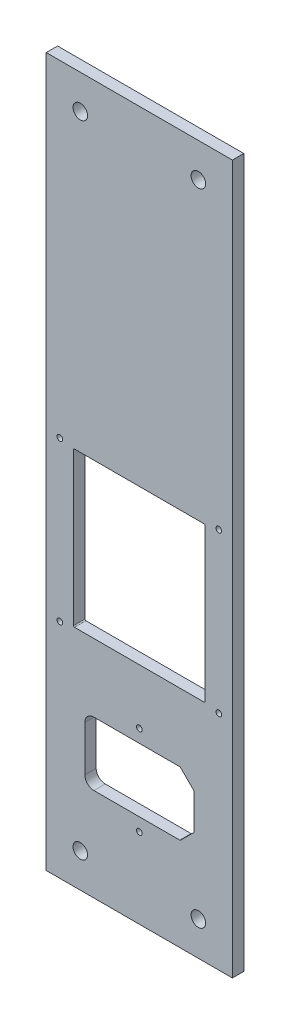
ISO-10303-21;
HEADER;
FILE_DESCRIPTION(('STEP AP214'),'2;1');
FILE_NAME('part.step','',(''),(''),'','','');
FILE_SCHEMA(('AUTOMOTIVE_DESIGN { 1 0 10303 214 1 1 1 1 }'));
ENDSEC;
DATA;
#1=APPLICATION_CONTEXT('core data for automotive mechanical design processes');
#2=APPLICATION_PROTOCOL_DEFINITION('international standard','automotive_design',2000,#1);
#3=PRODUCT_CONTEXT('',#1,'mechanical');
#4=PRODUCT('Part','Part','',(#3));
#5=PRODUCT_RELATED_PRODUCT_CATEGORY('part','',(#4));
#6=PRODUCT_DEFINITION_FORMATION('','',#4);
#7=PRODUCT_DEFINITION_CONTEXT('part definition',#1,'design');
#8=PRODUCT_DEFINITION('design','',#6,#7);
#9=PRODUCT_DEFINITION_SHAPE('','',#8);
#10=(LENGTH_UNIT() NAMED_UNIT(*) SI_UNIT(.MILLI.,.METRE.));
#11=(NAMED_UNIT(*) PLANE_ANGLE_UNIT() SI_UNIT($,.RADIAN.));
#12=(NAMED_UNIT(*) SI_UNIT($,.STERADIAN.) SOLID_ANGLE_UNIT());
#13=UNCERTAINTY_MEASURE_WITH_UNIT(LENGTH_MEASURE(1.E-05),#10,'distance_accuracy_value','');
#14=(GEOMETRIC_REPRESENTATION_CONTEXT(3) GLOBAL_UNCERTAINTY_ASSIGNED_CONTEXT((#13)) GLOBAL_UNIT_ASSIGNED_CONTEXT((#10,
#11,#12)) REPRESENTATION_CONTEXT('',''));
#15=CARTESIAN_POINT('',(0.,0.,0.));
#16=DIRECTION('',(0.,0.,1.));
#17=DIRECTION('',(1.,0.,0.));
#18=AXIS2_PLACEMENT_3D('',#15,#16,#17);
#19=CARTESIAN_POINT('',(41.,-156.,5.));
#20=DIRECTION('',(-1.,0.,0.));
#21=DIRECTION('',(0.,0.,1.));
#22=AXIS2_PLACEMENT_3D('',#19,#20,#21);
#23=PLANE('',#22);
#24=DIRECTION('',(0.,1.,0.));
#25=VECTOR('',#24,1.);
#26=CARTESIAN_POINT('',(41.,-156.,0.));
#27=LINE('',#26,#25);
#28=CARTESIAN_POINT('',(41.,-156.,0.));
#29=VERTEX_POINT('',#28);
#30=CARTESIAN_POINT('',(41.,156.,0.));
#31=VERTEX_POINT('',#30);
#32=EDGE_CURVE('E220',#29,#31,#27,.T.);
#33=ORIENTED_EDGE('',*,*,#32,.T.);
#34=DIRECTION('',(0.,0.,-1.));
#35=VECTOR('',#34,1.);
#36=CARTESIAN_POINT('',(41.,156.,5.));
#37=LINE('',#36,#35);
#38=CARTESIAN_POINT('',(41.,156.,5.));
#39=VERTEX_POINT('',#38);
#40=EDGE_CURVE('E201',#39,#31,#37,.T.);
#41=ORIENTED_EDGE('',*,*,#40,.F.);
#42=DIRECTION('',(0.,1.,0.));
#43=VECTOR('',#42,1.);
#44=CARTESIAN_POINT('',(41.,-156.,5.));
#45=LINE('',#44,#43);
#46=CARTESIAN_POINT('',(41.,-156.,5.));
#47=VERTEX_POINT('',#46);
#48=EDGE_CURVE('E208',#47,#39,#45,.T.);
#49=ORIENTED_EDGE('',*,*,#48,.F.);
#50=DIRECTION('',(0.,0.,-1.));
#51=VECTOR('',#50,1.);
#52=CARTESIAN_POINT('',(41.,-156.,5.));
#53=LINE('',#52,#51);
#54=EDGE_CURVE('E397',#47,#29,#53,.T.);
#55=ORIENTED_EDGE('',*,*,#54,.T.);
#56=EDGE_LOOP('',(#33,#41,#49,#55));
#57=FACE_BOUND('',#56,.T.);
#58=ADVANCED_FACE('F36',(#57),#23,.F.);
#59=CARTESIAN_POINT('',(-41.,156.,5.));
#60=DIRECTION('',(0.,-1.,0.));
#61=DIRECTION('',(0.,0.,-1.));
#62=AXIS2_PLACEMENT_3D('',#59,#60,#61);
#63=PLANE('',#62);
#64=DIRECTION('',(-1.,0.,0.));
#65=VECTOR('',#64,1.);
#66=CARTESIAN_POINT('',(-41.,156.,0.));
#67=LINE('',#66,#65);
#68=CARTESIAN_POINT('',(-41.,156.,0.));
#69=VERTEX_POINT('',#68);
#70=EDGE_CURVE('E399',#31,#69,#67,.T.);
#71=ORIENTED_EDGE('',*,*,#70,.T.);
#72=DIRECTION('',(0.,0.,-1.));
#73=VECTOR('',#72,1.);
#74=CARTESIAN_POINT('',(-41.,156.,5.));
#75=LINE('',#74,#73);
#76=CARTESIAN_POINT('',(-41.,156.,5.));
#77=VERTEX_POINT('',#76);
#78=EDGE_CURVE('E204',#77,#69,#75,.T.);
#79=ORIENTED_EDGE('',*,*,#78,.F.);
#80=DIRECTION('',(-1.,0.,0.));
#81=VECTOR('',#80,1.);
#82=CARTESIAN_POINT('',(-41.,156.,5.));
#83=LINE('',#82,#81);
#84=EDGE_CURVE('E197',#39,#77,#83,.T.);
#85=ORIENTED_EDGE('',*,*,#84,.F.);
#86=ORIENTED_EDGE('',*,*,#40,.T.);
#87=EDGE_LOOP('',(#71,#79,#85,#86));
#88=FACE_BOUND('',#87,.T.);
#89=ADVANCED_FACE('F199',(#88),#63,.F.);
#90=CARTESIAN_POINT('',(-41.,-156.,5.));
#91=DIRECTION('',(1.,0.,0.));
#92=DIRECTION('',(0.,0.,-1.));
#93=AXIS2_PLACEMENT_3D('',#90,#91,#92);
#94=PLANE('',#93);
#95=DIRECTION('',(0.,-1.,0.));
#96=VECTOR('',#95,1.);
#97=CARTESIAN_POINT('',(-41.,-156.,0.));
#98=LINE('',#97,#96);
#99=CARTESIAN_POINT('',(-41.,-156.,0.));
#100=VERTEX_POINT('',#99);
#101=EDGE_CURVE('E401',#69,#100,#98,.T.);
#102=ORIENTED_EDGE('',*,*,#101,.T.);
#103=DIRECTION('',(0.,0.,-1.));
#104=VECTOR('',#103,1.);
#105=CARTESIAN_POINT('',(-41.,-156.,5.));
#106=LINE('',#105,#104);
#107=CARTESIAN_POINT('',(-41.,-156.,5.));
#108=VERTEX_POINT('',#107);
#109=EDGE_CURVE('E226',#108,#100,#106,.T.);
#110=ORIENTED_EDGE('',*,*,#109,.F.);
#111=DIRECTION('',(0.,-1.,0.));
#112=VECTOR('',#111,1.);
#113=CARTESIAN_POINT('',(-41.,-156.,5.));
#114=LINE('',#113,#112);
#115=EDGE_CURVE('E207',#77,#108,#114,.T.);
#116=ORIENTED_EDGE('',*,*,#115,.F.);
#117=ORIENTED_EDGE('',*,*,#78,.T.);
#118=EDGE_LOOP('',(#102,#110,#116,#117));
#119=FACE_BOUND('',#118,.T.);
#120=ADVANCED_FACE('F413',(#119),#94,.F.);
#121=CARTESIAN_POINT('',(-41.,-156.,5.));
#122=DIRECTION('',(0.,1.,0.));
#123=DIRECTION('',(0.,0.,1.));
#124=AXIS2_PLACEMENT_3D('',#121,#122,#123);
#125=PLANE('',#124);
#126=DIRECTION('',(1.,0.,0.));
#127=VECTOR('',#126,1.);
#128=CARTESIAN_POINT('',(-41.,-156.,0.));
#129=LINE('',#128,#127);
#130=EDGE_CURVE('E217',#100,#29,#129,.T.);
#131=ORIENTED_EDGE('',*,*,#130,.T.);
#132=ORIENTED_EDGE('',*,*,#54,.F.);
#133=DIRECTION('',(1.,0.,0.));
#134=VECTOR('',#133,1.);
#135=CARTESIAN_POINT('',(-41.,-156.,5.));
#136=LINE('',#135,#134);
#137=EDGE_CURVE('E213',#108,#47,#136,.T.);
#138=ORIENTED_EDGE('',*,*,#137,.F.);
#139=ORIENTED_EDGE('',*,*,#109,.T.);
#140=EDGE_LOOP('',(#131,#132,#138,#139));
#141=FACE_BOUND('',#140,.T.);
#142=ADVANCED_FACE('F408',(#141),#125,.F.);
#143=CARTESIAN_POINT('',(0.,0.,5.));
#144=DIRECTION('',(0.,0.,-1.));
#145=DIRECTION('',(-1.,0.,0.));
#146=AXIS2_PLACEMENT_3D('',#143,#144,#145);
#147=PLANE('',#146);
#148=CARTESIAN_POINT('',(-26.,141.,5.));
#149=DIRECTION('',(0.,0.,1.));
#150=DIRECTION('',(1.,0.,0.));
#151=AXIS2_PLACEMENT_3D('',#148,#149,#150);
#152=CIRCLE('',#151,3.19999999999999);
#153=CARTESIAN_POINT('',(-22.8,141.,5.));
#154=VERTEX_POINT('',#153);
#155=EDGE_CURVE('E594',#154,#154,#152,.T.);
#156=ORIENTED_EDGE('',*,*,#155,.F.);
#157=EDGE_LOOP('',(#156));
#158=FACE_BOUND('',#157,.T.);
#159=CARTESIAN_POINT('',(26.,141.,5.));
#160=DIRECTION('',(0.,0.,1.));
#161=DIRECTION('',(1.,0.,0.));
#162=AXIS2_PLACEMENT_3D('',#159,#160,#161);
#163=CIRCLE('',#162,3.19999999999999);
#164=CARTESIAN_POINT('',(29.2,141.,5.));
#165=VERTEX_POINT('',#164);
#166=EDGE_CURVE('E590',#165,#165,#163,.T.);
#167=ORIENTED_EDGE('',*,*,#166,.F.);
#168=EDGE_LOOP('',(#167));
#169=FACE_BOUND('',#168,.T.);
#170=CARTESIAN_POINT('',(-26.,-141.,5.));
#171=DIRECTION('',(0.,0.,1.));
#172=DIRECTION('',(1.,0.,0.));
#173=AXIS2_PLACEMENT_3D('',#170,#171,#172);
#174=CIRCLE('',#173,3.19999999999999);
#175=CARTESIAN_POINT('',(-22.8,-141.,5.));
#176=VERTEX_POINT('',#175);
#177=EDGE_CURVE('E586',#176,#176,#174,.T.);
#178=ORIENTED_EDGE('',*,*,#177,.F.);
#179=EDGE_LOOP('',(#178));
#180=FACE_BOUND('',#179,.T.);
#181=CARTESIAN_POINT('',(26.,-141.,5.));
#182=DIRECTION('',(0.,0.,1.));
#183=DIRECTION('',(1.,0.,0.));
#184=AXIS2_PLACEMENT_3D('',#181,#182,#183);
#185=CIRCLE('',#184,3.19999999999999);
#186=CARTESIAN_POINT('',(29.2,-141.,5.));
#187=VERTEX_POINT('',#186);
#188=EDGE_CURVE('E582',#187,#187,#185,.T.);
#189=ORIENTED_EDGE('',*,*,#188,.F.);
#190=EDGE_LOOP('',(#189));
#191=FACE_BOUND('',#190,.T.);
#192=CARTESIAN_POINT('',(-35.,12.,5.));
#193=DIRECTION('',(0.,0.,1.));
#194=DIRECTION('',(1.,0.,0.));
#195=AXIS2_PLACEMENT_3D('',#192,#193,#194);
#196=CIRCLE('',#195,1.24999999999999);
#197=CARTESIAN_POINT('',(-33.75,12.,5.));
#198=VERTEX_POINT('',#197);
#199=EDGE_CURVE('E578',#198,#198,#196,.T.);
#200=ORIENTED_EDGE('',*,*,#199,.F.);
#201=EDGE_LOOP('',(#200));
#202=FACE_BOUND('',#201,.T.);
#203=CARTESIAN_POINT('',(35.,12.,5.));
#204=DIRECTION('',(0.,0.,1.));
#205=DIRECTION('',(1.,0.,0.));
#206=AXIS2_PLACEMENT_3D('',#203,#204,#205);
#207=CIRCLE('',#206,1.24999999999999);
#208=CARTESIAN_POINT('',(36.25,12.,5.));
#209=VERTEX_POINT('',#208);
#210=EDGE_CURVE('E574',#209,#209,#207,.T.);
#211=ORIENTED_EDGE('',*,*,#210,.F.);
#212=EDGE_LOOP('',(#211));
#213=FACE_BOUND('',#212,.T.);
#214=CARTESIAN_POINT('',(35.,-58.,5.));
#215=DIRECTION('',(0.,0.,1.));
#216=DIRECTION('',(1.,0.,0.));
#217=AXIS2_PLACEMENT_3D('',#214,#215,#216);
#218=CIRCLE('',#217,1.24999999999999);
#219=CARTESIAN_POINT('',(36.25,-58.,5.));
#220=VERTEX_POINT('',#219);
#221=EDGE_CURVE('E570',#220,#220,#218,.T.);
#222=ORIENTED_EDGE('',*,*,#221,.F.);
#223=EDGE_LOOP('',(#222));
#224=FACE_BOUND('',#223,.T.);
#225=CARTESIAN_POINT('',(-35.,-58.,5.));
#226=DIRECTION('',(0.,0.,1.));
#227=DIRECTION('',(1.,0.,0.));
#228=AXIS2_PLACEMENT_3D('',#225,#226,#227);
#229=CIRCLE('',#228,1.24999999999999);
#230=CARTESIAN_POINT('',(-33.75,-58.,5.));
#231=VERTEX_POINT('',#230);
#232=EDGE_CURVE('E565',#231,#231,#229,.T.);
#233=ORIENTED_EDGE('',*,*,#232,.F.);
#234=EDGE_LOOP('',(#233));
#235=FACE_BOUND('',#234,.T.);
#236=DIRECTION('',(-1.,0.,0.));
#237=VECTOR('',#236,1.);
#238=CARTESIAN_POINT('',(-29.,11.,5.));
#239=LINE('',#238,#237);
#240=CARTESIAN_POINT('',(28.5,11.,5.));
#241=VERTEX_POINT('',#240);
#242=CARTESIAN_POINT('',(-28.5,11.,5.));
#243=VERTEX_POINT('',#242);
#244=EDGE_CURVE('E350',#241,#243,#239,.T.);
#245=ORIENTED_EDGE('',*,*,#244,.F.);
#246=CARTESIAN_POINT('',(28.5,10.5,5.));
#247=DIRECTION('',(0.,0.,-1.));
#248=DIRECTION('',(-1.,0.,0.));
#249=AXIS2_PLACEMENT_3D('',#246,#247,#248);
#250=CIRCLE('',#249,0.5);
#251=CARTESIAN_POINT('',(29.,10.5,5.));
#252=VERTEX_POINT('',#251);
#253=EDGE_CURVE('E44',#241,#252,#250,.T.);
#254=ORIENTED_EDGE('',*,*,#253,.T.);
#255=DIRECTION('',(0.,1.,0.));
#256=VECTOR('',#255,1.);
#257=CARTESIAN_POINT('',(29.,-57.,5.));
#258=LINE('',#257,#256);
#259=CARTESIAN_POINT('',(29.,-56.5,5.));
#260=VERTEX_POINT('',#259);
#261=EDGE_CURVE('E349',#260,#252,#258,.T.);
#262=ORIENTED_EDGE('',*,*,#261,.F.);
#263=CARTESIAN_POINT('',(28.5,-56.5,5.));
#264=DIRECTION('',(0.,0.,-1.));
#265=DIRECTION('',(-1.,0.,0.));
#266=AXIS2_PLACEMENT_3D('',#263,#264,#265);
#267=CIRCLE('',#266,0.5);
#268=CARTESIAN_POINT('',(28.5,-57.,5.));
#269=VERTEX_POINT('',#268);
#270=EDGE_CURVE('E333',#260,#269,#267,.T.);
#271=ORIENTED_EDGE('',*,*,#270,.T.);
#272=DIRECTION('',(1.,0.,0.));
#273=VECTOR('',#272,1.);
#274=CARTESIAN_POINT('',(-29.,-57.,5.));
#275=LINE('',#274,#273);
#276=CARTESIAN_POINT('',(-28.5,-57.,5.));
#277=VERTEX_POINT('',#276);
#278=EDGE_CURVE('E369',#277,#269,#275,.T.);
#279=ORIENTED_EDGE('',*,*,#278,.F.);
#280=CARTESIAN_POINT('',(-28.5,-56.5,5.));
#281=DIRECTION('',(0.,0.,-1.));
#282=DIRECTION('',(-1.,0.,0.));
#283=AXIS2_PLACEMENT_3D('',#280,#281,#282);
#284=CIRCLE('',#283,0.5);
#285=CARTESIAN_POINT('',(-29.,-56.5,5.));
#286=VERTEX_POINT('',#285);
#287=EDGE_CURVE('E337',#277,#286,#284,.T.);
#288=ORIENTED_EDGE('',*,*,#287,.T.);
#289=DIRECTION('',(0.,-1.,0.));
#290=VECTOR('',#289,1.);
#291=CARTESIAN_POINT('',(-29.,-57.,5.));
#292=LINE('',#291,#290);
#293=CARTESIAN_POINT('',(-29.,10.5,5.));
#294=VERTEX_POINT('',#293);
#295=EDGE_CURVE('E376',#294,#286,#292,.T.);
#296=ORIENTED_EDGE('',*,*,#295,.F.);
#297=CARTESIAN_POINT('',(-28.5,10.5,5.));
#298=DIRECTION('',(0.,0.,-1.));
#299=DIRECTION('',(-1.,0.,0.));
#300=AXIS2_PLACEMENT_3D('',#297,#298,#299);
#301=CIRCLE('',#300,0.5);
#302=EDGE_CURVE('E341',#294,#243,#301,.T.);
#303=ORIENTED_EDGE('',*,*,#302,.T.);
#304=EDGE_LOOP('',(#245,#254,#262,#271,#279,#288,#296,#303));
#305=FACE_BOUND('',#304,.T.);
#306=CARTESIAN_POINT('',(0.,-120.75,5.));
#307=DIRECTION('',(0.,0.,1.));
#308=DIRECTION('',(1.,0.,0.));
#309=AXIS2_PLACEMENT_3D('',#306,#307,#308);
#310=CIRCLE('',#309,1.25);
#311=CARTESIAN_POINT('',(1.25,-120.75,5.));
#312=VERTEX_POINT('',#311);
#313=EDGE_CURVE('E246',#312,#312,#310,.T.);
#314=ORIENTED_EDGE('',*,*,#313,.F.);
#315=EDGE_LOOP('',(#314));
#316=FACE_BOUND('',#315,.T.);
#317=CARTESIAN_POINT('',(0.,-81.25,5.));
#318=DIRECTION('',(0.,0.,1.));
#319=DIRECTION('',(1.,0.,0.));
#320=AXIS2_PLACEMENT_3D('',#317,#318,#319);
#321=CIRCLE('',#320,1.25);
#322=CARTESIAN_POINT('',(1.25,-81.25,5.));
#323=VERTEX_POINT('',#322);
#324=EDGE_CURVE('E242',#323,#323,#321,.T.);
#325=ORIENTED_EDGE('',*,*,#324,.F.);
#326=EDGE_LOOP('',(#325));
#327=FACE_BOUND('',#326,.T.);
#328=DIRECTION('',(-1.,0.,0.));
#329=VECTOR('',#328,1.);
#330=CARTESIAN_POINT('',(-24.,-87.,5.));
#331=LINE('',#330,#329);
#332=CARTESIAN_POINT('',(17.7928932188134,-87.,5.));
#333=VERTEX_POINT('',#332);
#334=CARTESIAN_POINT('',(-20.,-87.,5.));
#335=VERTEX_POINT('',#334);
#336=EDGE_CURVE('E387',#333,#335,#331,.T.);
#337=ORIENTED_EDGE('',*,*,#336,.F.);
#338=CARTESIAN_POINT('',(17.7928932188134,-87.5,5.));
#339=DIRECTION('',(0.,0.,-1.));
#340=DIRECTION('',(-1.,0.,0.));
#341=AXIS2_PLACEMENT_3D('',#338,#339,#340);
#342=CIRCLE('',#341,0.5);
#343=CARTESIAN_POINT('',(18.1464466094067,-87.1464466094067,5.));
#344=VERTEX_POINT('',#343);
#345=EDGE_CURVE('E329',#333,#344,#342,.T.);
#346=ORIENTED_EDGE('',*,*,#345,.T.);
#347=DIRECTION('',(-0.707106781186551,0.707106781186544,0.));
#348=VECTOR('',#347,1.);
#349=CARTESIAN_POINT('',(-34.5000000000001,-34.5000000000004,5.));
#350=LINE('',#349,#348);
#351=CARTESIAN_POINT('',(23.8535533905933,-92.8535533905933,5.));
#352=VERTEX_POINT('',#351);
#353=EDGE_CURVE('E252',#344,#352,#350,.F.);
#354=ORIENTED_EDGE('',*,*,#353,.T.);
#355=CARTESIAN_POINT('',(23.5,-93.2071067811866,5.));
#356=DIRECTION('',(0.,0.,-1.));
#357=DIRECTION('',(-1.,0.,0.));
#358=AXIS2_PLACEMENT_3D('',#355,#356,#357);
#359=CIRCLE('',#358,0.5);
#360=CARTESIAN_POINT('',(24.,-93.2071067811866,5.));
#361=VERTEX_POINT('',#360);
#362=EDGE_CURVE('E327',#352,#361,#359,.T.);
#363=ORIENTED_EDGE('',*,*,#362,.T.);
#364=DIRECTION('',(0.,1.,0.));
#365=VECTOR('',#364,1.);
#366=CARTESIAN_POINT('',(24.,-115.,5.));
#367=LINE('',#366,#365);
#368=CARTESIAN_POINT('',(24.,-108.792893218813,5.));
#369=VERTEX_POINT('',#368);
#370=EDGE_CURVE('E241',#369,#361,#367,.T.);
#371=ORIENTED_EDGE('',*,*,#370,.F.);
#372=CARTESIAN_POINT('',(23.5,-108.792893218813,5.));
#373=DIRECTION('',(0.,0.,-1.));
#374=DIRECTION('',(-1.,0.,0.));
#375=AXIS2_PLACEMENT_3D('',#372,#373,#374);
#376=CIRCLE('',#375,0.5);
#377=CARTESIAN_POINT('',(23.8535533905933,-109.146446609407,5.));
#378=VERTEX_POINT('',#377);
#379=EDGE_CURVE('E321',#369,#378,#376,.T.);
#380=ORIENTED_EDGE('',*,*,#379,.T.);
#381=DIRECTION('',(0.707106781186543,0.707106781186552,0.));
#382=VECTOR('',#381,1.);
#383=CARTESIAN_POINT('',(66.5000000000001,-66.4999999999992,5.));
#384=LINE('',#383,#382);
#385=CARTESIAN_POINT('',(18.1464466094068,-114.853553390593,5.));
#386=VERTEX_POINT('',#385);
#387=EDGE_CURVE('E237',#378,#386,#384,.F.);
#388=ORIENTED_EDGE('',*,*,#387,.T.);
#389=CARTESIAN_POINT('',(17.7928932188135,-114.5,5.));
#390=DIRECTION('',(0.,0.,-1.));
#391=DIRECTION('',(-1.,0.,0.));
#392=AXIS2_PLACEMENT_3D('',#389,#390,#391);
#393=CIRCLE('',#392,0.5);
#394=CARTESIAN_POINT('',(17.7928932188135,-115.,5.));
#395=VERTEX_POINT('',#394);
#396=EDGE_CURVE('E319',#386,#395,#393,.T.);
#397=ORIENTED_EDGE('',*,*,#396,.T.);
#398=DIRECTION('',(1.,0.,0.));
#399=VECTOR('',#398,1.);
#400=CARTESIAN_POINT('',(-24.,-115.,5.));
#401=LINE('',#400,#399);
#402=CARTESIAN_POINT('',(-20.,-115.,5.));
#403=VERTEX_POINT('',#402);
#404=EDGE_CURVE('E392',#403,#395,#401,.T.);
#405=ORIENTED_EDGE('',*,*,#404,.F.);
#406=CARTESIAN_POINT('',(-20.,-111.,5.));
#407=DIRECTION('',(0.,0.,-1.));
#408=DIRECTION('',(-1.,0.,0.));
#409=AXIS2_PLACEMENT_3D('',#406,#407,#408);
#410=CIRCLE('',#409,4.);
#411=CARTESIAN_POINT('',(-24.,-111.,5.));
#412=VERTEX_POINT('',#411);
#413=EDGE_CURVE('E268',#403,#412,#410,.T.);
#414=ORIENTED_EDGE('',*,*,#413,.T.);
#415=DIRECTION('',(0.,-1.,0.));
#416=VECTOR('',#415,1.);
#417=CARTESIAN_POINT('',(-24.,-115.,5.));
#418=LINE('',#417,#416);
#419=CARTESIAN_POINT('',(-24.,-91.,5.));
#420=VERTEX_POINT('',#419);
#421=EDGE_CURVE('E389',#420,#412,#418,.T.);
#422=ORIENTED_EDGE('',*,*,#421,.F.);
#423=CARTESIAN_POINT('',(-20.,-91.,5.));
#424=DIRECTION('',(0.,0.,-1.));
#425=DIRECTION('',(-1.,0.,0.));
#426=AXIS2_PLACEMENT_3D('',#423,#424,#425);
#427=CIRCLE('',#426,4.);
#428=EDGE_CURVE('E273',#420,#335,#427,.T.);
#429=ORIENTED_EDGE('',*,*,#428,.T.);
#430=EDGE_LOOP('',(#337,#346,#354,#363,#371,#380,#388,#397,#405,#414,#422,#429));
#431=FACE_BOUND('',#430,.T.);
#432=ORIENTED_EDGE('',*,*,#48,.T.);
#433=ORIENTED_EDGE('',*,*,#84,.T.);
#434=ORIENTED_EDGE('',*,*,#115,.T.);
#435=ORIENTED_EDGE('',*,*,#137,.T.);
#436=EDGE_LOOP('',(#432,#433,#434,#435));
#437=FACE_BOUND('',#436,.T.);
#438=ADVANCED_FACE('F211',(#158,#169,#180,#191,#202,#213,#224,#235,#305,#316,#327,#431,#437),
#147,.F.);
#439=CARTESIAN_POINT('',(0.,0.,0.));
#440=DIRECTION('',(0.,0.,-1.));
#441=DIRECTION('',(-1.,0.,0.));
#442=AXIS2_PLACEMENT_3D('',#439,#440,#441);
#443=PLANE('',#442);
#444=CARTESIAN_POINT('',(-26.,141.,0.));
#445=DIRECTION('',(0.,0.,1.));
#446=DIRECTION('',(1.,0.,0.));
#447=AXIS2_PLACEMENT_3D('',#444,#445,#446);
#448=CIRCLE('',#447,3.19999999999999);
#449=CARTESIAN_POINT('',(-22.8,141.,0.));
#450=VERTEX_POINT('',#449);
#451=EDGE_CURVE('E537',#450,#450,#448,.T.);
#452=ORIENTED_EDGE('',*,*,#451,.T.);
#453=EDGE_LOOP('',(#452));
#454=FACE_BOUND('',#453,.T.);
#455=CARTESIAN_POINT('',(26.,141.,0.));
#456=DIRECTION('',(0.,0.,1.));
#457=DIRECTION('',(1.,0.,0.));
#458=AXIS2_PLACEMENT_3D('',#455,#456,#457);
#459=CIRCLE('',#458,3.19999999999999);
#460=CARTESIAN_POINT('',(29.2,141.,0.));
#461=VERTEX_POINT('',#460);
#462=EDGE_CURVE('E541',#461,#461,#459,.T.);
#463=ORIENTED_EDGE('',*,*,#462,.T.);
#464=EDGE_LOOP('',(#463));
#465=FACE_BOUND('',#464,.T.);
#466=CARTESIAN_POINT('',(-26.,-141.,0.));
#467=DIRECTION('',(0.,0.,1.));
#468=DIRECTION('',(1.,0.,0.));
#469=AXIS2_PLACEMENT_3D('',#466,#467,#468);
#470=CIRCLE('',#469,3.19999999999999);
#471=CARTESIAN_POINT('',(-22.8,-141.,0.));
#472=VERTEX_POINT('',#471);
#473=EDGE_CURVE('E545',#472,#472,#470,.T.);
#474=ORIENTED_EDGE('',*,*,#473,.T.);
#475=EDGE_LOOP('',(#474));
#476=FACE_BOUND('',#475,.T.);
#477=CARTESIAN_POINT('',(26.,-141.,0.));
#478=DIRECTION('',(0.,0.,1.));
#479=DIRECTION('',(1.,0.,0.));
#480=AXIS2_PLACEMENT_3D('',#477,#478,#479);
#481=CIRCLE('',#480,3.19999999999999);
#482=CARTESIAN_POINT('',(29.2,-141.,0.));
#483=VERTEX_POINT('',#482);
#484=EDGE_CURVE('E549',#483,#483,#481,.T.);
#485=ORIENTED_EDGE('',*,*,#484,.T.);
#486=EDGE_LOOP('',(#485));
#487=FACE_BOUND('',#486,.T.);
#488=CARTESIAN_POINT('',(-35.,12.,0.));
#489=DIRECTION('',(0.,0.,1.));
#490=DIRECTION('',(1.,0.,0.));
#491=AXIS2_PLACEMENT_3D('',#488,#489,#490);
#492=CIRCLE('',#491,1.25);
#493=CARTESIAN_POINT('',(-33.75,12.,0.));
#494=VERTEX_POINT('',#493);
#495=EDGE_CURVE('E553',#494,#494,#492,.T.);
#496=ORIENTED_EDGE('',*,*,#495,.T.);
#497=EDGE_LOOP('',(#496));
#498=FACE_BOUND('',#497,.T.);
#499=CARTESIAN_POINT('',(35.,12.,0.));
#500=DIRECTION('',(0.,0.,1.));
#501=DIRECTION('',(1.,0.,0.));
#502=AXIS2_PLACEMENT_3D('',#499,#500,#501);
#503=CIRCLE('',#502,1.25);
#504=CARTESIAN_POINT('',(36.25,12.,0.));
#505=VERTEX_POINT('',#504);
#506=EDGE_CURVE('E557',#505,#505,#503,.T.);
#507=ORIENTED_EDGE('',*,*,#506,.T.);
#508=EDGE_LOOP('',(#507));
#509=FACE_BOUND('',#508,.T.);
#510=CARTESIAN_POINT('',(35.,-58.,0.));
#511=DIRECTION('',(0.,0.,1.));
#512=DIRECTION('',(1.,0.,0.));
#513=AXIS2_PLACEMENT_3D('',#510,#511,#512);
#514=CIRCLE('',#513,1.25);
#515=CARTESIAN_POINT('',(36.25,-58.,0.));
#516=VERTEX_POINT('',#515);
#517=EDGE_CURVE('E561',#516,#516,#514,.T.);
#518=ORIENTED_EDGE('',*,*,#517,.T.);
#519=EDGE_LOOP('',(#518));
#520=FACE_BOUND('',#519,.T.);
#521=CARTESIAN_POINT('',(-35.,-58.,0.));
#522=DIRECTION('',(0.,0.,1.));
#523=DIRECTION('',(1.,0.,0.));
#524=AXIS2_PLACEMENT_3D('',#521,#522,#523);
#525=CIRCLE('',#524,1.25);
#526=CARTESIAN_POINT('',(-33.75,-58.,0.));
#527=VERTEX_POINT('',#526);
#528=EDGE_CURVE('E358',#527,#527,#525,.T.);
#529=ORIENTED_EDGE('',*,*,#528,.T.);
#530=EDGE_LOOP('',(#529));
#531=FACE_BOUND('',#530,.T.);
#532=DIRECTION('',(1.,0.,0.));
#533=VECTOR('',#532,1.);
#534=CARTESIAN_POINT('',(-29.,-57.,0.));
#535=LINE('',#534,#533);
#536=CARTESIAN_POINT('',(-28.5,-57.,0.));
#537=VERTEX_POINT('',#536);
#538=CARTESIAN_POINT('',(28.5,-57.,0.));
#539=VERTEX_POINT('',#538);
#540=EDGE_CURVE('E367',#537,#539,#535,.T.);
#541=ORIENTED_EDGE('',*,*,#540,.T.);
#542=CARTESIAN_POINT('',(28.5,-56.5,0.));
#543=DIRECTION('',(0.,0.,-1.));
#544=DIRECTION('',(-1.,0.,0.));
#545=AXIS2_PLACEMENT_3D('',#542,#543,#544);
#546=CIRCLE('',#545,0.5);
#547=CARTESIAN_POINT('',(29.,-56.5,0.));
#548=VERTEX_POINT('',#547);
#549=EDGE_CURVE('E335',#539,#548,#546,.F.);
#550=ORIENTED_EDGE('',*,*,#549,.T.);
#551=DIRECTION('',(0.,1.,0.));
#552=VECTOR('',#551,1.);
#553=CARTESIAN_POINT('',(29.,-57.,0.));
#554=LINE('',#553,#552);
#555=CARTESIAN_POINT('',(29.,10.5,0.));
#556=VERTEX_POINT('',#555);
#557=EDGE_CURVE('E364',#548,#556,#554,.T.);
#558=ORIENTED_EDGE('',*,*,#557,.T.);
#559=CARTESIAN_POINT('',(28.5,10.5,0.));
#560=DIRECTION('',(0.,0.,-1.));
#561=DIRECTION('',(-1.,0.,0.));
#562=AXIS2_PLACEMENT_3D('',#559,#560,#561);
#563=CIRCLE('',#562,0.5);
#564=CARTESIAN_POINT('',(28.5,11.,0.));
#565=VERTEX_POINT('',#564);
#566=EDGE_CURVE('E11',#556,#565,#563,.F.);
#567=ORIENTED_EDGE('',*,*,#566,.T.);
#568=DIRECTION('',(-1.,0.,0.));
#569=VECTOR('',#568,1.);
#570=CARTESIAN_POINT('',(-29.,11.,0.));
#571=LINE('',#570,#569);
#572=CARTESIAN_POINT('',(-28.5,11.,0.));
#573=VERTEX_POINT('',#572);
#574=EDGE_CURVE('E361',#565,#573,#571,.T.);
#575=ORIENTED_EDGE('',*,*,#574,.T.);
#576=CARTESIAN_POINT('',(-28.5,10.5,0.));
#577=DIRECTION('',(0.,0.,-1.));
#578=DIRECTION('',(-1.,0.,0.));
#579=AXIS2_PLACEMENT_3D('',#576,#577,#578);
#580=CIRCLE('',#579,0.5);
#581=CARTESIAN_POINT('',(-29.,10.5,0.));
#582=VERTEX_POINT('',#581);
#583=EDGE_CURVE('E343',#573,#582,#580,.F.);
#584=ORIENTED_EDGE('',*,*,#583,.T.);
#585=DIRECTION('',(0.,-1.,0.));
#586=VECTOR('',#585,1.);
#587=CARTESIAN_POINT('',(-29.,-57.,0.));
#588=LINE('',#587,#586);
#589=CARTESIAN_POINT('',(-29.,-56.5,0.));
#590=VERTEX_POINT('',#589);
#591=EDGE_CURVE('E363',#582,#590,#588,.T.);
#592=ORIENTED_EDGE('',*,*,#591,.T.);
#593=CARTESIAN_POINT('',(-28.5,-56.5,0.));
#594=DIRECTION('',(0.,0.,-1.));
#595=DIRECTION('',(-1.,0.,0.));
#596=AXIS2_PLACEMENT_3D('',#593,#594,#595);
#597=CIRCLE('',#596,0.5);
#598=EDGE_CURVE('E339',#590,#537,#597,.F.);
#599=ORIENTED_EDGE('',*,*,#598,.T.);
#600=EDGE_LOOP('',(#541,#550,#558,#567,#575,#584,#592,#599));
#601=FACE_BOUND('',#600,.T.);
#602=CARTESIAN_POINT('',(0.,-120.75,0.));
#603=DIRECTION('',(0.,0.,-1.));
#604=DIRECTION('',(-1.,0.,0.));
#605=AXIS2_PLACEMENT_3D('',#602,#603,#604);
#606=CIRCLE('',#605,1.25);
#607=CARTESIAN_POINT('',(-1.25,-120.75,0.));
#608=VERTEX_POINT('',#607);
#609=EDGE_CURVE('E243',#608,#608,#606,.T.);
#610=ORIENTED_EDGE('',*,*,#609,.F.);
#611=EDGE_LOOP('',(#610));
#612=FACE_BOUND('',#611,.T.);
#613=CARTESIAN_POINT('',(0.,-81.25,0.));
#614=DIRECTION('',(0.,0.,-1.));
#615=DIRECTION('',(-1.,0.,0.));
#616=AXIS2_PLACEMENT_3D('',#613,#614,#615);
#617=CIRCLE('',#616,1.25);
#618=CARTESIAN_POINT('',(-1.25,-81.25,0.));
#619=VERTEX_POINT('',#618);
#620=EDGE_CURVE('E238',#619,#619,#617,.T.);
#621=ORIENTED_EDGE('',*,*,#620,.F.);
#622=EDGE_LOOP('',(#621));
#623=FACE_BOUND('',#622,.T.);
#624=DIRECTION('',(0.,-1.,0.));
#625=VECTOR('',#624,1.);
#626=CARTESIAN_POINT('',(24.,0.,0.));
#627=LINE('',#626,#625);
#628=CARTESIAN_POINT('',(24.,-93.2071067811866,0.));
#629=VERTEX_POINT('',#628);
#630=CARTESIAN_POINT('',(24.,-108.792893218813,0.));
#631=VERTEX_POINT('',#630);
#632=EDGE_CURVE('E234',#629,#631,#627,.T.);
#633=ORIENTED_EDGE('',*,*,#632,.F.);
#634=CARTESIAN_POINT('',(23.5,-93.2071067811866,0.));
#635=DIRECTION('',(0.,0.,-1.));
#636=DIRECTION('',(-1.,0.,0.));
#637=AXIS2_PLACEMENT_3D('',#634,#635,#636);
#638=CIRCLE('',#637,0.5);
#639=CARTESIAN_POINT('',(23.8535533905933,-92.8535533905933,0.));
#640=VERTEX_POINT('',#639);
#641=EDGE_CURVE('E325',#629,#640,#638,.F.);
#642=ORIENTED_EDGE('',*,*,#641,.T.);
#643=DIRECTION('',(0.707106781186551,-0.707106781186544,0.));
#644=VECTOR('',#643,1.);
#645=CARTESIAN_POINT('',(17.9999999999999,-87.,0.));
#646=LINE('',#645,#644);
#647=CARTESIAN_POINT('',(18.1464466094067,-87.1464466094067,0.));
#648=VERTEX_POINT('',#647);
#649=EDGE_CURVE('E255',#640,#648,#646,.F.);
#650=ORIENTED_EDGE('',*,*,#649,.T.);
#651=CARTESIAN_POINT('',(17.7928932188134,-87.5,0.));
#652=DIRECTION('',(0.,0.,-1.));
#653=DIRECTION('',(-1.,0.,0.));
#654=AXIS2_PLACEMENT_3D('',#651,#652,#653);
#655=CIRCLE('',#654,0.5);
#656=CARTESIAN_POINT('',(17.7928932188134,-87.,0.));
#657=VERTEX_POINT('',#656);
#658=EDGE_CURVE('E331',#648,#657,#655,.F.);
#659=ORIENTED_EDGE('',*,*,#658,.T.);
#660=DIRECTION('',(1.,0.,0.));
#661=VECTOR('',#660,1.);
#662=CARTESIAN_POINT('',(0.,-87.,0.));
#663=LINE('',#662,#661);
#664=CARTESIAN_POINT('',(-20.,-87.,0.));
#665=VERTEX_POINT('',#664);
#666=EDGE_CURVE('E221',#665,#657,#663,.T.);
#667=ORIENTED_EDGE('',*,*,#666,.F.);
#668=CARTESIAN_POINT('',(-20.,-91.,0.));
#669=DIRECTION('',(0.,0.,-1.));
#670=DIRECTION('',(-1.,0.,0.));
#671=AXIS2_PLACEMENT_3D('',#668,#669,#670);
#672=CIRCLE('',#671,4.);
#673=CARTESIAN_POINT('',(-24.,-91.,0.));
#674=VERTEX_POINT('',#673);
#675=EDGE_CURVE('E276',#665,#674,#672,.F.);
#676=ORIENTED_EDGE('',*,*,#675,.T.);
#677=DIRECTION('',(0.,1.,0.));
#678=VECTOR('',#677,1.);
#679=CARTESIAN_POINT('',(-24.,0.,0.));
#680=LINE('',#679,#678);
#681=CARTESIAN_POINT('',(-24.,-111.,0.));
#682=VERTEX_POINT('',#681);
#683=EDGE_CURVE('E224',#682,#674,#680,.T.);
#684=ORIENTED_EDGE('',*,*,#683,.F.);
#685=CARTESIAN_POINT('',(-20.,-111.,0.));
#686=DIRECTION('',(0.,0.,-1.));
#687=DIRECTION('',(-1.,0.,0.));
#688=AXIS2_PLACEMENT_3D('',#685,#686,#687);
#689=CIRCLE('',#688,4.);
#690=CARTESIAN_POINT('',(-20.,-115.,0.));
#691=VERTEX_POINT('',#690);
#692=EDGE_CURVE('E270',#682,#691,#689,.F.);
#693=ORIENTED_EDGE('',*,*,#692,.T.);
#694=DIRECTION('',(-1.,0.,0.));
#695=VECTOR('',#694,1.);
#696=CARTESIAN_POINT('',(0.,-115.,0.));
#697=LINE('',#696,#695);
#698=CARTESIAN_POINT('',(17.7928932188135,-115.,0.));
#699=VERTEX_POINT('',#698);
#700=EDGE_CURVE('E232',#699,#691,#697,.T.);
#701=ORIENTED_EDGE('',*,*,#700,.F.);
#702=CARTESIAN_POINT('',(17.7928932188135,-114.5,0.));
#703=DIRECTION('',(0.,0.,-1.));
#704=DIRECTION('',(-1.,0.,0.));
#705=AXIS2_PLACEMENT_3D('',#702,#703,#704);
#706=CIRCLE('',#705,0.5);
#707=CARTESIAN_POINT('',(18.1464466094068,-114.853553390593,0.));
#708=VERTEX_POINT('',#707);
#709=EDGE_CURVE('E317',#699,#708,#706,.F.);
#710=ORIENTED_EDGE('',*,*,#709,.T.);
#711=DIRECTION('',(-0.707106781186543,-0.707106781186552,0.));
#712=VECTOR('',#711,1.);
#713=CARTESIAN_POINT('',(24.,-109.,0.));
#714=LINE('',#713,#712);
#715=CARTESIAN_POINT('',(23.8535533905933,-109.146446609407,0.));
#716=VERTEX_POINT('',#715);
#717=EDGE_CURVE('E249',#708,#716,#714,.F.);
#718=ORIENTED_EDGE('',*,*,#717,.T.);
#719=CARTESIAN_POINT('',(23.5,-108.792893218813,0.));
#720=DIRECTION('',(0.,0.,-1.));
#721=DIRECTION('',(-1.,0.,0.));
#722=AXIS2_PLACEMENT_3D('',#719,#720,#721);
#723=CIRCLE('',#722,0.5);
#724=EDGE_CURVE('E323',#716,#631,#723,.F.);
#725=ORIENTED_EDGE('',*,*,#724,.T.);
#726=EDGE_LOOP('',(#633,#642,#650,#659,#667,#676,#684,#693,#701,#710,#718,#725));
#727=FACE_BOUND('',#726,.T.);
#728=ORIENTED_EDGE('',*,*,#32,.F.);
#729=ORIENTED_EDGE('',*,*,#130,.F.);
#730=ORIENTED_EDGE('',*,*,#101,.F.);
#731=ORIENTED_EDGE('',*,*,#70,.F.);
#732=EDGE_LOOP('',(#728,#729,#730,#731));
#733=FACE_BOUND('',#732,.T.);
#734=ADVANCED_FACE('F412',(#454,#465,#476,#487,#498,#509,#520,#531,#601,#612,#623,#727,#733),
#443,.T.);
#735=CARTESIAN_POINT('',(24.,-115.,-5.));
#736=DIRECTION('',(1.,0.,0.));
#737=DIRECTION('',(0.,0.,-1.));
#738=AXIS2_PLACEMENT_3D('',#735,#736,#737);
#739=PLANE('',#738);
#740=ORIENTED_EDGE('',*,*,#632,.T.);
#741=DIRECTION('',(0.,0.,-1.));
#742=VECTOR('',#741,1.);
#743=CARTESIAN_POINT('',(24.,-108.792893218813,5.));
#744=LINE('',#743,#742);
#745=EDGE_CURVE('E288',#631,#369,#744,.F.);
#746=ORIENTED_EDGE('',*,*,#745,.T.);
#747=ORIENTED_EDGE('',*,*,#370,.T.);
#748=DIRECTION('',(0.,0.,1.));
#749=VECTOR('',#748,1.);
#750=CARTESIAN_POINT('',(24.,-93.2071067811866,0.));
#751=LINE('',#750,#749);
#752=EDGE_CURVE('E285',#361,#629,#751,.F.);
#753=ORIENTED_EDGE('',*,*,#752,.T.);
#754=EDGE_LOOP('',(#740,#746,#747,#753));
#755=FACE_BOUND('',#754,.T.);
#756=ADVANCED_FACE('F516',(#755),#739,.F.);
#757=CARTESIAN_POINT('',(-24.,-115.,-5.));
#758=DIRECTION('',(0.,-1.,0.));
#759=DIRECTION('',(0.,0.,-1.));
#760=AXIS2_PLACEMENT_3D('',#757,#758,#759);
#761=PLANE('',#760);
#762=ORIENTED_EDGE('',*,*,#404,.T.);
#763=DIRECTION('',(0.,0.,1.));
#764=VECTOR('',#763,1.);
#765=CARTESIAN_POINT('',(17.7928932188135,-115.,0.));
#766=LINE('',#765,#764);
#767=EDGE_CURVE('E278',#395,#699,#766,.F.);
#768=ORIENTED_EDGE('',*,*,#767,.T.);
#769=ORIENTED_EDGE('',*,*,#700,.T.);
#770=DIRECTION('',(0.,0.,1.));
#771=VECTOR('',#770,1.);
#772=CARTESIAN_POINT('',(-20.,-115.,5.));
#773=LINE('',#772,#771);
#774=EDGE_CURVE('E258',#691,#403,#773,.T.);
#775=ORIENTED_EDGE('',*,*,#774,.T.);
#776=EDGE_LOOP('',(#762,#768,#769,#775));
#777=FACE_BOUND('',#776,.T.);
#778=ADVANCED_FACE('F512',(#777),#761,.F.);
#779=CARTESIAN_POINT('',(-24.,-115.,-5.));
#780=DIRECTION('',(-1.,0.,0.));
#781=DIRECTION('',(0.,0.,1.));
#782=AXIS2_PLACEMENT_3D('',#779,#780,#781);
#783=PLANE('',#782);
#784=ORIENTED_EDGE('',*,*,#421,.T.);
#785=DIRECTION('',(0.,0.,1.));
#786=VECTOR('',#785,1.);
#787=CARTESIAN_POINT('',(-24.,-111.,0.));
#788=LINE('',#787,#786);
#789=EDGE_CURVE('E264',#412,#682,#788,.F.);
#790=ORIENTED_EDGE('',*,*,#789,.T.);
#791=ORIENTED_EDGE('',*,*,#683,.T.);
#792=DIRECTION('',(0.,0.,1.));
#793=VECTOR('',#792,1.);
#794=CARTESIAN_POINT('',(-24.,-91.,5.));
#795=LINE('',#794,#793);
#796=EDGE_CURVE('E261',#674,#420,#795,.T.);
#797=ORIENTED_EDGE('',*,*,#796,.T.);
#798=EDGE_LOOP('',(#784,#790,#791,#797));
#799=FACE_BOUND('',#798,.T.);
#800=ADVANCED_FACE('F515',(#799),#783,.F.);
#801=CARTESIAN_POINT('',(-24.,-87.,-5.));
#802=DIRECTION('',(0.,1.,0.));
#803=DIRECTION('',(0.,0.,1.));
#804=AXIS2_PLACEMENT_3D('',#801,#802,#803);
#805=PLANE('',#804);
#806=ORIENTED_EDGE('',*,*,#666,.T.);
#807=DIRECTION('',(0.,0.,-1.));
#808=VECTOR('',#807,1.);
#809=CARTESIAN_POINT('',(17.7928932188134,-87.,5.));
#810=LINE('',#809,#808);
#811=EDGE_CURVE('E295',#657,#333,#810,.F.);
#812=ORIENTED_EDGE('',*,*,#811,.T.);
#813=ORIENTED_EDGE('',*,*,#336,.T.);
#814=DIRECTION('',(0.,0.,1.));
#815=VECTOR('',#814,1.);
#816=CARTESIAN_POINT('',(-20.,-87.,0.));
#817=LINE('',#816,#815);
#818=EDGE_CURVE('E266',#335,#665,#817,.F.);
#819=ORIENTED_EDGE('',*,*,#818,.T.);
#820=EDGE_LOOP('',(#806,#812,#813,#819));
#821=FACE_BOUND('',#820,.T.);
#822=ADVANCED_FACE('F510',(#821),#805,.F.);
#823=CARTESIAN_POINT('',(0.,-81.25,-5.));
#824=DIRECTION('',(0.,0.,1.));
#825=DIRECTION('',(1.,0.,0.));
#826=AXIS2_PLACEMENT_3D('',#823,#824,#825);
#827=CYLINDRICAL_SURFACE('',#826,1.25);
#828=ORIENTED_EDGE('',*,*,#620,.T.);
#829=EDGE_LOOP('',(#828));
#830=FACE_BOUND('',#829,.T.);
#831=ORIENTED_EDGE('',*,*,#324,.T.);
#832=EDGE_LOOP('',(#831));
#833=FACE_BOUND('',#832,.T.);
#834=ADVANCED_FACE('F506',(#830,#833),#827,.F.);
#835=CARTESIAN_POINT('',(0.,-120.75,-5.));
#836=DIRECTION('',(0.,0.,1.));
#837=DIRECTION('',(1.,0.,0.));
#838=AXIS2_PLACEMENT_3D('',#835,#836,#837);
#839=CYLINDRICAL_SURFACE('',#838,1.25);
#840=ORIENTED_EDGE('',*,*,#609,.T.);
#841=EDGE_LOOP('',(#840));
#842=FACE_BOUND('',#841,.T.);
#843=ORIENTED_EDGE('',*,*,#313,.T.);
#844=EDGE_LOOP('',(#843));
#845=FACE_BOUND('',#844,.T.);
#846=ADVANCED_FACE('F431',(#842,#845),#839,.F.);
#847=CARTESIAN_POINT('',(24.,-109.,-5.));
#848=DIRECTION('',(-0.707106781186552,0.707106781186543,0.));
#849=DIRECTION('',(0.,0.,-1.));
#850=AXIS2_PLACEMENT_3D('',#847,#848,#849);
#851=PLANE('',#850);
#852=ORIENTED_EDGE('',*,*,#717,.F.);
#853=DIRECTION('',(0.,0.,-1.));
#854=VECTOR('',#853,1.);
#855=CARTESIAN_POINT('',(18.1464466094068,-114.853553390593,5.));
#856=LINE('',#855,#854);
#857=EDGE_CURVE('E283',#708,#386,#856,.F.);
#858=ORIENTED_EDGE('',*,*,#857,.T.);
#859=ORIENTED_EDGE('',*,*,#387,.F.);
#860=DIRECTION('',(0.,0.,1.));
#861=VECTOR('',#860,1.);
#862=CARTESIAN_POINT('',(23.8535533905933,-109.146446609407,0.));
#863=LINE('',#862,#861);
#864=EDGE_CURVE('E281',#378,#716,#863,.F.);
#865=ORIENTED_EDGE('',*,*,#864,.T.);
#866=EDGE_LOOP('',(#852,#858,#859,#865));
#867=FACE_BOUND('',#866,.T.);
#868=ADVANCED_FACE('F427',(#867),#851,.T.);
#869=CARTESIAN_POINT('',(17.9999999999999,-87.,-5.));
#870=DIRECTION('',(-0.707106781186544,-0.707106781186551,0.));
#871=DIRECTION('',(0.,0.,-1.));
#872=AXIS2_PLACEMENT_3D('',#869,#870,#871);
#873=PLANE('',#872);
#874=ORIENTED_EDGE('',*,*,#649,.F.);
#875=DIRECTION('',(0.,0.,-1.));
#876=VECTOR('',#875,1.);
#877=CARTESIAN_POINT('',(23.8535533905933,-92.8535533905933,5.));
#878=LINE('',#877,#876);
#879=EDGE_CURVE('E293',#640,#352,#878,.F.);
#880=ORIENTED_EDGE('',*,*,#879,.T.);
#881=ORIENTED_EDGE('',*,*,#353,.F.);
#882=DIRECTION('',(0.,0.,1.));
#883=VECTOR('',#882,1.);
#884=CARTESIAN_POINT('',(18.1464466094067,-87.1464466094067,0.));
#885=LINE('',#884,#883);
#886=EDGE_CURVE('E291',#344,#648,#885,.F.);
#887=ORIENTED_EDGE('',*,*,#886,.T.);
#888=EDGE_LOOP('',(#874,#880,#881,#887));
#889=FACE_BOUND('',#888,.T.);
#890=ADVANCED_FACE('F430',(#889),#873,.T.);
#891=CARTESIAN_POINT('',(-20.,-111.,-5.));
#892=DIRECTION('',(0.,0.,-1.));
#893=DIRECTION('',(-1.,0.,0.));
#894=AXIS2_PLACEMENT_3D('',#891,#892,#893);
#895=CYLINDRICAL_SURFACE('',#894,4.);
#896=ORIENTED_EDGE('',*,*,#692,.F.);
#897=ORIENTED_EDGE('',*,*,#789,.F.);
#898=ORIENTED_EDGE('',*,*,#413,.F.);
#899=ORIENTED_EDGE('',*,*,#774,.F.);
#900=EDGE_LOOP('',(#896,#897,#898,#899));
#901=FACE_BOUND('',#900,.T.);
#902=ADVANCED_FACE('F435',(#901),#895,.F.);
#903=CARTESIAN_POINT('',(-20.,-91.,-5.));
#904=DIRECTION('',(0.,0.,-1.));
#905=DIRECTION('',(-1.,0.,0.));
#906=AXIS2_PLACEMENT_3D('',#903,#904,#905);
#907=CYLINDRICAL_SURFACE('',#906,4.);
#908=ORIENTED_EDGE('',*,*,#675,.F.);
#909=ORIENTED_EDGE('',*,*,#818,.F.);
#910=ORIENTED_EDGE('',*,*,#428,.F.);
#911=ORIENTED_EDGE('',*,*,#796,.F.);
#912=EDGE_LOOP('',(#908,#909,#910,#911));
#913=FACE_BOUND('',#912,.T.);
#914=ADVANCED_FACE('F439',(#913),#907,.F.);
#915=CARTESIAN_POINT('',(29.,-57.,0.));
#916=DIRECTION('',(1.,0.,0.));
#917=DIRECTION('',(0.,0.,-1.));
#918=AXIS2_PLACEMENT_3D('',#915,#916,#917);
#919=PLANE('',#918);
#920=ORIENTED_EDGE('',*,*,#557,.F.);
#921=DIRECTION('',(0.,0.,1.));
#922=VECTOR('',#921,1.);
#923=CARTESIAN_POINT('',(29.,-56.5,5.));
#924=LINE('',#923,#922);
#925=EDGE_CURVE('E300',#548,#260,#924,.T.);
#926=ORIENTED_EDGE('',*,*,#925,.T.);
#927=ORIENTED_EDGE('',*,*,#261,.T.);
#928=DIRECTION('',(0.,0.,1.));
#929=VECTOR('',#928,1.);
#930=CARTESIAN_POINT('',(29.,10.5,0.));
#931=LINE('',#930,#929);
#932=EDGE_CURVE('E298',#252,#556,#931,.F.);
#933=ORIENTED_EDGE('',*,*,#932,.T.);
#934=EDGE_LOOP('',(#920,#926,#927,#933));
#935=FACE_BOUND('',#934,.T.);
#936=ADVANCED_FACE('F356',(#935),#919,.F.);
#937=CARTESIAN_POINT('',(-29.,-57.,0.));
#938=DIRECTION('',(0.,-1.,0.));
#939=DIRECTION('',(0.,0.,-1.));
#940=AXIS2_PLACEMENT_3D('',#937,#938,#939);
#941=PLANE('',#940);
#942=ORIENTED_EDGE('',*,*,#278,.T.);
#943=DIRECTION('',(0.,0.,1.));
#944=VECTOR('',#943,1.);
#945=CARTESIAN_POINT('',(28.5,-57.,0.));
#946=LINE('',#945,#944);
#947=EDGE_CURVE('E306',#269,#539,#946,.F.);
#948=ORIENTED_EDGE('',*,*,#947,.T.);
#949=ORIENTED_EDGE('',*,*,#540,.F.);
#950=DIRECTION('',(0.,0.,1.));
#951=VECTOR('',#950,1.);
#952=CARTESIAN_POINT('',(-28.5,-57.,5.));
#953=LINE('',#952,#951);
#954=EDGE_CURVE('E303',#537,#277,#953,.T.);
#955=ORIENTED_EDGE('',*,*,#954,.T.);
#956=EDGE_LOOP('',(#942,#948,#949,#955));
#957=FACE_BOUND('',#956,.T.);
#958=ADVANCED_FACE('F487',(#957),#941,.F.);
#959=CARTESIAN_POINT('',(-29.,-57.,0.));
#960=DIRECTION('',(-1.,0.,0.));
#961=DIRECTION('',(0.,0.,1.));
#962=AXIS2_PLACEMENT_3D('',#959,#960,#961);
#963=PLANE('',#962);
#964=ORIENTED_EDGE('',*,*,#295,.T.);
#965=DIRECTION('',(0.,0.,1.));
#966=VECTOR('',#965,1.);
#967=CARTESIAN_POINT('',(-29.,-56.5,0.));
#968=LINE('',#967,#966);
#969=EDGE_CURVE('E311',#286,#590,#968,.F.);
#970=ORIENTED_EDGE('',*,*,#969,.T.);
#971=ORIENTED_EDGE('',*,*,#591,.F.);
#972=DIRECTION('',(0.,0.,1.));
#973=VECTOR('',#972,1.);
#974=CARTESIAN_POINT('',(-29.,10.5,5.));
#975=LINE('',#974,#973);
#976=EDGE_CURVE('E308',#582,#294,#975,.T.);
#977=ORIENTED_EDGE('',*,*,#976,.T.);
#978=EDGE_LOOP('',(#964,#970,#971,#977));
#979=FACE_BOUND('',#978,.T.);
#980=ADVANCED_FACE('F480',(#979),#963,.F.);
#981=CARTESIAN_POINT('',(-29.,11.,0.));
#982=DIRECTION('',(0.,1.,0.));
#983=DIRECTION('',(0.,0.,1.));
#984=AXIS2_PLACEMENT_3D('',#981,#982,#983);
#985=PLANE('',#984);
#986=ORIENTED_EDGE('',*,*,#244,.T.);
#987=DIRECTION('',(0.,0.,1.));
#988=VECTOR('',#987,1.);
#989=CARTESIAN_POINT('',(-28.5,11.,0.));
#990=LINE('',#989,#988);
#991=EDGE_CURVE('E51',#243,#573,#990,.F.);
#992=ORIENTED_EDGE('',*,*,#991,.T.);
#993=ORIENTED_EDGE('',*,*,#574,.F.);
#994=DIRECTION('',(0.,0.,1.));
#995=VECTOR('',#994,1.);
#996=CARTESIAN_POINT('',(28.5,11.,5.));
#997=LINE('',#996,#995);
#998=EDGE_CURVE('E313',#565,#241,#997,.T.);
#999=ORIENTED_EDGE('',*,*,#998,.T.);
#1000=EDGE_LOOP('',(#986,#992,#993,#999));
#1001=FACE_BOUND('',#1000,.T.);
#1002=ADVANCED_FACE('F360',(#1001),#985,.F.);
#1003=CARTESIAN_POINT('',(-35.,-58.,5.));
#1004=DIRECTION('',(0.,0.,1.));
#1005=DIRECTION('',(1.,0.,0.));
#1006=AXIS2_PLACEMENT_3D('',#1003,#1004,#1005);
#1007=CYLINDRICAL_SURFACE('',#1006,1.24999999999999);
#1008=ORIENTED_EDGE('',*,*,#528,.F.);
#1009=EDGE_LOOP('',(#1008));
#1010=FACE_BOUND('',#1009,.T.);
#1011=ORIENTED_EDGE('',*,*,#232,.T.);
#1012=EDGE_LOOP('',(#1011));
#1013=FACE_BOUND('',#1012,.T.);
#1014=ADVANCED_FACE('F499',(#1010,#1013),#1007,.F.);
#1015=CARTESIAN_POINT('',(35.,-58.,5.));
#1016=DIRECTION('',(0.,0.,1.));
#1017=DIRECTION('',(1.,0.,0.));
#1018=AXIS2_PLACEMENT_3D('',#1015,#1016,#1017);
#1019=CYLINDRICAL_SURFACE('',#1018,1.24999999999999);
#1020=ORIENTED_EDGE('',*,*,#517,.F.);
#1021=EDGE_LOOP('',(#1020));
#1022=FACE_BOUND('',#1021,.T.);
#1023=ORIENTED_EDGE('',*,*,#221,.T.);
#1024=EDGE_LOOP('',(#1023));
#1025=FACE_BOUND('',#1024,.T.);
#1026=ADVANCED_FACE('F615',(#1022,#1025),#1019,.F.);
#1027=CARTESIAN_POINT('',(35.,12.,5.));
#1028=DIRECTION('',(0.,0.,1.));
#1029=DIRECTION('',(1.,0.,0.));
#1030=AXIS2_PLACEMENT_3D('',#1027,#1028,#1029);
#1031=CYLINDRICAL_SURFACE('',#1030,1.24999999999999);
#1032=ORIENTED_EDGE('',*,*,#506,.F.);
#1033=EDGE_LOOP('',(#1032));
#1034=FACE_BOUND('',#1033,.T.);
#1035=ORIENTED_EDGE('',*,*,#210,.T.);
#1036=EDGE_LOOP('',(#1035));
#1037=FACE_BOUND('',#1036,.T.);
#1038=ADVANCED_FACE('F619',(#1034,#1037),#1031,.F.);
#1039=CARTESIAN_POINT('',(-35.,12.,5.));
#1040=DIRECTION('',(0.,0.,1.));
#1041=DIRECTION('',(1.,0.,0.));
#1042=AXIS2_PLACEMENT_3D('',#1039,#1040,#1041);
#1043=CYLINDRICAL_SURFACE('',#1042,1.24999999999999);
#1044=ORIENTED_EDGE('',*,*,#495,.F.);
#1045=EDGE_LOOP('',(#1044));
#1046=FACE_BOUND('',#1045,.T.);
#1047=ORIENTED_EDGE('',*,*,#199,.T.);
#1048=EDGE_LOOP('',(#1047));
#1049=FACE_BOUND('',#1048,.T.);
#1050=ADVANCED_FACE('F448',(#1046,#1049),#1043,.F.);
#1051=CARTESIAN_POINT('',(17.7928932188135,-114.5,-5.));
#1052=DIRECTION('',(0.,0.,-1.));
#1053=DIRECTION('',(-1.,0.,0.));
#1054=AXIS2_PLACEMENT_3D('',#1051,#1052,#1053);
#1055=CYLINDRICAL_SURFACE('',#1054,0.5);
#1056=ORIENTED_EDGE('',*,*,#396,.F.);
#1057=ORIENTED_EDGE('',*,*,#857,.F.);
#1058=ORIENTED_EDGE('',*,*,#709,.F.);
#1059=ORIENTED_EDGE('',*,*,#767,.F.);
#1060=EDGE_LOOP('',(#1056,#1057,#1058,#1059));
#1061=FACE_BOUND('',#1060,.T.);
#1062=ADVANCED_FACE('F444',(#1061),#1055,.F.);
#1063=CARTESIAN_POINT('',(23.5,-108.792893218813,-5.));
#1064=DIRECTION('',(0.,0.,1.));
#1065=DIRECTION('',(1.,0.,0.));
#1066=AXIS2_PLACEMENT_3D('',#1063,#1064,#1065);
#1067=CYLINDRICAL_SURFACE('',#1066,0.5);
#1068=ORIENTED_EDGE('',*,*,#724,.F.);
#1069=ORIENTED_EDGE('',*,*,#864,.F.);
#1070=ORIENTED_EDGE('',*,*,#379,.F.);
#1071=ORIENTED_EDGE('',*,*,#745,.F.);
#1072=EDGE_LOOP('',(#1068,#1069,#1070,#1071));
#1073=FACE_BOUND('',#1072,.T.);
#1074=ADVANCED_FACE('F447',(#1073),#1067,.F.);
#1075=CARTESIAN_POINT('',(23.5,-93.2071067811866,-5.));
#1076=DIRECTION('',(0.,0.,-1.));
#1077=DIRECTION('',(-1.,0.,0.));
#1078=AXIS2_PLACEMENT_3D('',#1075,#1076,#1077);
#1079=CYLINDRICAL_SURFACE('',#1078,0.5);
#1080=ORIENTED_EDGE('',*,*,#362,.F.);
#1081=ORIENTED_EDGE('',*,*,#879,.F.);
#1082=ORIENTED_EDGE('',*,*,#641,.F.);
#1083=ORIENTED_EDGE('',*,*,#752,.F.);
#1084=EDGE_LOOP('',(#1080,#1081,#1082,#1083));
#1085=FACE_BOUND('',#1084,.T.);
#1086=ADVANCED_FACE('F452',(#1085),#1079,.F.);
#1087=CARTESIAN_POINT('',(17.7928932188134,-87.5,-5.));
#1088=DIRECTION('',(0.,0.,1.));
#1089=DIRECTION('',(1.,0.,0.));
#1090=AXIS2_PLACEMENT_3D('',#1087,#1088,#1089);
#1091=CYLINDRICAL_SURFACE('',#1090,0.5);
#1092=ORIENTED_EDGE('',*,*,#658,.F.);
#1093=ORIENTED_EDGE('',*,*,#886,.F.);
#1094=ORIENTED_EDGE('',*,*,#345,.F.);
#1095=ORIENTED_EDGE('',*,*,#811,.F.);
#1096=EDGE_LOOP('',(#1092,#1093,#1094,#1095));
#1097=FACE_BOUND('',#1096,.T.);
#1098=ADVANCED_FACE('F456',(#1097),#1091,.F.);
#1099=CARTESIAN_POINT('',(28.5,-56.5,0.));
#1100=DIRECTION('',(0.,0.,-1.));
#1101=DIRECTION('',(-1.,0.,0.));
#1102=AXIS2_PLACEMENT_3D('',#1099,#1100,#1101);
#1103=CYLINDRICAL_SURFACE('',#1102,0.5);
#1104=ORIENTED_EDGE('',*,*,#549,.F.);
#1105=ORIENTED_EDGE('',*,*,#947,.F.);
#1106=ORIENTED_EDGE('',*,*,#270,.F.);
#1107=ORIENTED_EDGE('',*,*,#925,.F.);
#1108=EDGE_LOOP('',(#1104,#1105,#1106,#1107));
#1109=FACE_BOUND('',#1108,.T.);
#1110=ADVANCED_FACE('F460',(#1109),#1103,.F.);
#1111=CARTESIAN_POINT('',(-28.5,-56.5,0.));
#1112=DIRECTION('',(0.,0.,-1.));
#1113=DIRECTION('',(-1.,0.,0.));
#1114=AXIS2_PLACEMENT_3D('',#1111,#1112,#1113);
#1115=CYLINDRICAL_SURFACE('',#1114,0.5);
#1116=ORIENTED_EDGE('',*,*,#598,.F.);
#1117=ORIENTED_EDGE('',*,*,#969,.F.);
#1118=ORIENTED_EDGE('',*,*,#287,.F.);
#1119=ORIENTED_EDGE('',*,*,#954,.F.);
#1120=EDGE_LOOP('',(#1116,#1117,#1118,#1119));
#1121=FACE_BOUND('',#1120,.T.);
#1122=ADVANCED_FACE('F464',(#1121),#1115,.F.);
#1123=CARTESIAN_POINT('',(-28.5,10.5,0.));
#1124=DIRECTION('',(0.,0.,-1.));
#1125=DIRECTION('',(-1.,0.,0.));
#1126=AXIS2_PLACEMENT_3D('',#1123,#1124,#1125);
#1127=CYLINDRICAL_SURFACE('',#1126,0.5);
#1128=ORIENTED_EDGE('',*,*,#583,.F.);
#1129=ORIENTED_EDGE('',*,*,#991,.F.);
#1130=ORIENTED_EDGE('',*,*,#302,.F.);
#1131=ORIENTED_EDGE('',*,*,#976,.F.);
#1132=EDGE_LOOP('',(#1128,#1129,#1130,#1131));
#1133=FACE_BOUND('',#1132,.T.);
#1134=ADVANCED_FACE('F467',(#1133),#1127,.F.);
#1135=CARTESIAN_POINT('',(28.5,10.5,0.));
#1136=DIRECTION('',(0.,0.,-1.));
#1137=DIRECTION('',(-1.,0.,0.));
#1138=AXIS2_PLACEMENT_3D('',#1135,#1136,#1137);
#1139=CYLINDRICAL_SURFACE('',#1138,0.5);
#1140=ORIENTED_EDGE('',*,*,#566,.F.);
#1141=ORIENTED_EDGE('',*,*,#932,.F.);
#1142=ORIENTED_EDGE('',*,*,#253,.F.);
#1143=ORIENTED_EDGE('',*,*,#998,.F.);
#1144=EDGE_LOOP('',(#1140,#1141,#1142,#1143));
#1145=FACE_BOUND('',#1144,.T.);
#1146=ADVANCED_FACE('F38',(#1145),#1139,.F.);
#1147=CARTESIAN_POINT('',(26.,-141.,5.));
#1148=DIRECTION('',(0.,0.,1.));
#1149=DIRECTION('',(1.,0.,0.));
#1150=AXIS2_PLACEMENT_3D('',#1147,#1148,#1149);
#1151=CYLINDRICAL_SURFACE('',#1150,3.19999999999999);
#1152=ORIENTED_EDGE('',*,*,#484,.F.);
#1153=EDGE_LOOP('',(#1152));
#1154=FACE_BOUND('',#1153,.T.);
#1155=ORIENTED_EDGE('',*,*,#188,.T.);
#1156=EDGE_LOOP('',(#1155));
#1157=FACE_BOUND('',#1156,.T.);
#1158=ADVANCED_FACE('F474',(#1154,#1157),#1151,.F.);
#1159=CARTESIAN_POINT('',(-26.,-141.,5.));
#1160=DIRECTION('',(0.,0.,1.));
#1161=DIRECTION('',(1.,0.,0.));
#1162=AXIS2_PLACEMENT_3D('',#1159,#1160,#1161);
#1163=CYLINDRICAL_SURFACE('',#1162,3.19999999999999);
#1164=ORIENTED_EDGE('',*,*,#473,.F.);
#1165=EDGE_LOOP('',(#1164));
#1166=FACE_BOUND('',#1165,.T.);
#1167=ORIENTED_EDGE('',*,*,#177,.T.);
#1168=EDGE_LOOP('',(#1167));
#1169=FACE_BOUND('',#1168,.T.);
#1170=ADVANCED_FACE('F633',(#1166,#1169),#1163,.F.);
#1171=CARTESIAN_POINT('',(26.,141.,5.));
#1172=DIRECTION('',(0.,0.,1.));
#1173=DIRECTION('',(1.,0.,0.));
#1174=AXIS2_PLACEMENT_3D('',#1171,#1172,#1173);
#1175=CYLINDRICAL_SURFACE('',#1174,3.19999999999999);
#1176=ORIENTED_EDGE('',*,*,#462,.F.);
#1177=EDGE_LOOP('',(#1176));
#1178=FACE_BOUND('',#1177,.T.);
#1179=ORIENTED_EDGE('',*,*,#166,.T.);
#1180=EDGE_LOOP('',(#1179));
#1181=FACE_BOUND('',#1180,.T.);
#1182=ADVANCED_FACE('F637',(#1178,#1181),#1175,.F.);
#1183=CARTESIAN_POINT('',(-26.,141.,5.));
#1184=DIRECTION('',(0.,0.,1.));
#1185=DIRECTION('',(1.,0.,0.));
#1186=AXIS2_PLACEMENT_3D('',#1183,#1184,#1185);
#1187=CYLINDRICAL_SURFACE('',#1186,3.19999999999999);
#1188=ORIENTED_EDGE('',*,*,#451,.F.);
#1189=EDGE_LOOP('',(#1188));
#1190=FACE_BOUND('',#1189,.T.);
#1191=ORIENTED_EDGE('',*,*,#155,.T.);
#1192=EDGE_LOOP('',(#1191));
#1193=FACE_BOUND('',#1192,.T.);
#1194=ADVANCED_FACE('F598',(#1190,#1193),#1187,.F.);
#1195=CLOSED_SHELL('',(#58,#89,#120,#142,#438,#734,#756,#778,#800,#822,#834,#846,#868,#890,#902,
#914,#936,#958,#980,#1002,#1014,#1026,#1038,#1050,#1062,#1074,#1086,#1098,#1110,#1122,#1134,
#1146,#1158,#1170,#1182,#1194));
#1196=MANIFOLD_SOLID_BREP('B2',#1195);
#1197=ADVANCED_BREP_SHAPE_REPRESENTATION('',(#18,#1196),#14);
#1198=SHAPE_DEFINITION_REPRESENTATION(#9,#1197);
ENDSEC;
END-ISO-10303-21;
